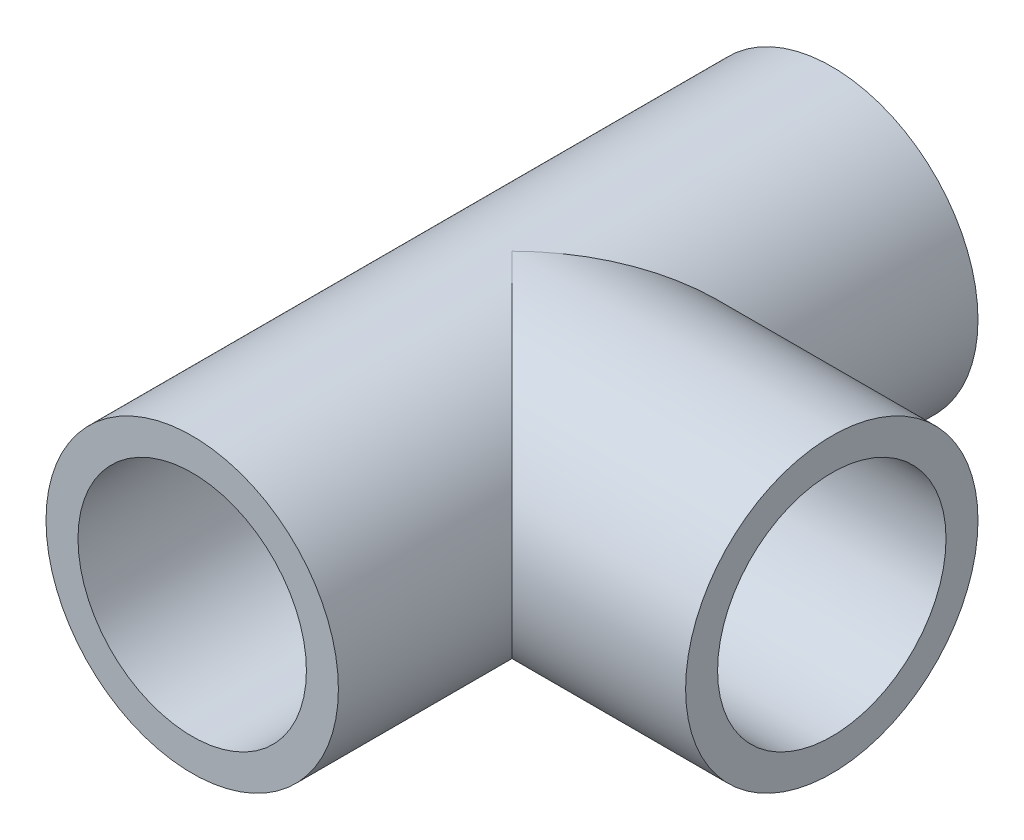
ISO-10303-21;
HEADER;
FILE_DESCRIPTION(('STEP AP214'),'2;1');
FILE_NAME('part.step','',(''),(''),'','','');
FILE_SCHEMA(('AUTOMOTIVE_DESIGN { 1 0 10303 214 1 1 1 1 }'));
ENDSEC;
DATA;
#1=APPLICATION_CONTEXT('core data for automotive mechanical design processes');
#2=APPLICATION_PROTOCOL_DEFINITION('international standard','automotive_design',2000,#1);
#3=PRODUCT_CONTEXT('',#1,'mechanical');
#4=PRODUCT('Part','Part','',(#3));
#5=PRODUCT_RELATED_PRODUCT_CATEGORY('part','',(#4));
#6=PRODUCT_DEFINITION_FORMATION('','',#4);
#7=PRODUCT_DEFINITION_CONTEXT('part definition',#1,'design');
#8=PRODUCT_DEFINITION('design','',#6,#7);
#9=PRODUCT_DEFINITION_SHAPE('','',#8);
#10=(LENGTH_UNIT() NAMED_UNIT(*) SI_UNIT(.MILLI.,.METRE.));
#11=(NAMED_UNIT(*) PLANE_ANGLE_UNIT() SI_UNIT($,.RADIAN.));
#12=(NAMED_UNIT(*) SI_UNIT($,.STERADIAN.) SOLID_ANGLE_UNIT());
#13=UNCERTAINTY_MEASURE_WITH_UNIT(LENGTH_MEASURE(1.E-05),#10,'distance_accuracy_value','');
#14=(GEOMETRIC_REPRESENTATION_CONTEXT(3) GLOBAL_UNCERTAINTY_ASSIGNED_CONTEXT((#13)) GLOBAL_UNIT_ASSIGNED_CONTEXT((#10,
#11,#12)) REPRESENTATION_CONTEXT('',''));
#15=CARTESIAN_POINT('',(0.,0.,0.));
#16=DIRECTION('',(0.,0.,1.));
#17=DIRECTION('',(1.,0.,0.));
#18=AXIS2_PLACEMENT_3D('',#15,#16,#17);
#19=CARTESIAN_POINT('',(0.,0.,35.));
#20=DIRECTION('',(0.,0.,-1.));
#21=DIRECTION('',(-1.,0.,0.));
#22=AXIS2_PLACEMENT_3D('',#19,#20,#21);
#23=CYLINDRICAL_SURFACE('',#22,16.);
#24=CARTESIAN_POINT('',(0.,0.,-35.));
#25=DIRECTION('',(0.,0.,1.));
#26=DIRECTION('',(1.,0.,0.));
#27=AXIS2_PLACEMENT_3D('',#24,#25,#26);
#28=CIRCLE('',#27,16.);
#29=CARTESIAN_POINT('',(16.,0.,-35.));
#30=VERTEX_POINT('',#29);
#31=EDGE_CURVE('E107',#30,#30,#28,.T.);
#32=ORIENTED_EDGE('',*,*,#31,.T.);
#33=EDGE_LOOP('',(#32));
#34=FACE_BOUND('',#33,.T.);
#35=CARTESIAN_POINT('',(0.,0.,35.));
#36=DIRECTION('',(0.,0.,1.));
#37=DIRECTION('',(1.,0.,0.));
#38=AXIS2_PLACEMENT_3D('',#35,#36,#37);
#39=CIRCLE('',#38,16.);
#40=CARTESIAN_POINT('',(16.,0.,35.));
#41=VERTEX_POINT('',#40);
#42=EDGE_CURVE('E110',#41,#41,#39,.T.);
#43=ORIENTED_EDGE('',*,*,#42,.F.);
#44=EDGE_LOOP('',(#43));
#45=FACE_BOUND('',#44,.T.);
#46=CARTESIAN_POINT('',(0.,0.,0.));
#47=DIRECTION('',(-0.707106781186547,0.,-0.707106781186547));
#48=DIRECTION('',(0.707106781186547,0.,-0.707106781186547));
#49=AXIS2_PLACEMENT_3D('',#46,#47,#48);
#50=ELLIPSE('',#49,22.6274169979695,16.);
#51=CARTESIAN_POINT('',(0.,-16.,0.));
#52=VERTEX_POINT('',#51);
#53=CARTESIAN_POINT('',(0.,16.,0.));
#54=VERTEX_POINT('',#53);
#55=EDGE_CURVE('E86',#52,#54,#50,.F.);
#56=ORIENTED_EDGE('',*,*,#55,.F.);
#57=CARTESIAN_POINT('',(0.,0.,0.));
#58=DIRECTION('',(0.707106781186547,0.,-0.707106781186547));
#59=DIRECTION('',(-0.707106781186547,0.,-0.707106781186547));
#60=AXIS2_PLACEMENT_3D('',#57,#58,#59);
#61=ELLIPSE('',#60,22.6274169979695,16.);
#62=EDGE_CURVE('E88',#54,#52,#61,.T.);
#63=ORIENTED_EDGE('',*,*,#62,.F.);
#64=EDGE_LOOP('',(#56,#63));
#65=FACE_BOUND('',#64,.T.);
#66=ADVANCED_FACE('F37',(#34,#45,#65),#23,.T.);
#67=CARTESIAN_POINT('',(0.,0.,35.));
#68=DIRECTION('',(0.,0.,-1.));
#69=DIRECTION('',(-1.,0.,0.));
#70=AXIS2_PLACEMENT_3D('',#67,#68,#69);
#71=CYLINDRICAL_SURFACE('',#70,12.5);
#72=CARTESIAN_POINT('',(0.,0.,35.));
#73=DIRECTION('',(0.,0.,1.));
#74=DIRECTION('',(1.,0.,0.));
#75=AXIS2_PLACEMENT_3D('',#72,#73,#74);
#76=CIRCLE('',#75,12.5);
#77=CARTESIAN_POINT('',(12.5,0.,35.));
#78=VERTEX_POINT('',#77);
#79=EDGE_CURVE('E104',#78,#78,#76,.T.);
#80=ORIENTED_EDGE('',*,*,#79,.T.);
#81=EDGE_LOOP('',(#80));
#82=FACE_BOUND('',#81,.T.);
#83=CARTESIAN_POINT('',(0.,0.,-35.));
#84=DIRECTION('',(0.,0.,1.));
#85=DIRECTION('',(1.,0.,0.));
#86=AXIS2_PLACEMENT_3D('',#83,#84,#85);
#87=CIRCLE('',#86,12.5);
#88=CARTESIAN_POINT('',(12.5,0.,-35.));
#89=VERTEX_POINT('',#88);
#90=EDGE_CURVE('E90',#89,#89,#87,.T.);
#91=ORIENTED_EDGE('',*,*,#90,.F.);
#92=EDGE_LOOP('',(#91));
#93=FACE_BOUND('',#92,.T.);
#94=CARTESIAN_POINT('',(0.,12.5,9.98749217771909));
#95=CARTESIAN_POINT('',(0.144765939258269,12.5000039713035,9.9874792375071));
#96=CARTESIAN_POINT('',(0.289500768758806,12.4974842219506,9.99064164597223));
#97=CARTESIAN_POINT('',(0.578496388531646,12.4874428530207,10.0031928812679));
#98=CARTESIAN_POINT('',(0.722757272903658,12.4799222952672,10.0125803863203));
#99=CARTESIAN_POINT('',(1.15346240868712,12.4499846032809,10.0498235033874));
#100=CARTESIAN_POINT('',(1.43868016846623,12.4201908621868,10.086761191272));
#101=CARTESIAN_POINT('',(1.99838143732547,12.3424144689702,10.1817705778644));
#102=CARTESIAN_POINT('',(2.27296204134154,12.2947136259312,10.2395143074388));
#103=CARTESIAN_POINT('',(2.8142411856663,12.1822217089497,10.3730943724714));
#104=CARTESIAN_POINT('',(3.08093393454397,12.1174184082355,10.4489436481017));
#105=CARTESIAN_POINT('',(3.66587879723391,11.9550657753382,10.634607832145));
#106=CARTESIAN_POINT('',(3.98177716623853,11.8534088032738,10.7482208979897));
#107=CARTESIAN_POINT('',(4.59892316278278,11.6278940118057,10.9917979176121));
#108=CARTESIAN_POINT('',(4.90016766189858,11.5040314779987,11.1217653417897));
#109=CARTESIAN_POINT('',(5.4897150239081,11.2347095097614,11.3937772832068));
#110=CARTESIAN_POINT('',(5.77792676334296,11.0891217721173,11.535891246081));
#111=CARTESIAN_POINT('',(6.33950858826032,10.7779255937651,11.8271616260655));
#112=CARTESIAN_POINT('',(6.61287986056642,10.6123187574545,11.9763174782319));
#113=CARTESIAN_POINT('',(7.15178768157901,10.2571325058059,12.282001520992));
#114=CARTESIAN_POINT('',(7.41693488086361,10.0670411636648,12.4386205480631));
#115=CARTESIAN_POINT('',(7.93149504051984,9.66683070553962,12.7521376989664));
#116=CARTESIAN_POINT('',(8.18090746714291,9.45671091076489,12.909035832081));
#117=CARTESIAN_POINT('',(8.66300567572775,9.0171243831435,13.2198257919539));
#118=CARTESIAN_POINT('',(8.89572270172659,8.7876956327564,13.3737228197949));
#119=CARTESIAN_POINT('',(9.34408100362736,8.30936729608235,13.6760542441486));
#120=CARTESIAN_POINT('',(9.55972331331234,8.06046889039586,13.8244889710827));
#121=CARTESIAN_POINT('',(9.96348044291906,7.55505976650153,14.1067737967742));
#122=CARTESIAN_POINT('',(10.1523952110983,7.29938788073774,14.2409792968047));
#123=CARTESIAN_POINT('',(10.5121729040342,6.77099323074985,14.4996604904861));
#124=CARTESIAN_POINT('',(10.6830382089783,6.49827272230116,14.6241374664755));
#125=CARTESIAN_POINT('',(11.0050875858175,5.9365654161209,14.8610249120178));
#126=CARTESIAN_POINT('',(11.156278832046,5.64758460323973,14.9734397774965));
#127=CARTESIAN_POINT('',(11.4372550959724,5.05438832992194,15.1839436527159));
#128=CARTESIAN_POINT('',(11.5670437810643,4.7501754912099,15.2820351164844));
#129=CARTESIAN_POINT('',(11.7851804238597,4.17597912731154,15.4478563972793));
#130=CARTESIAN_POINT('',(11.876831858331,3.90792600784162,15.5179355333653));
#131=CARTESIAN_POINT('',(12.0423676196806,3.36338036329094,15.6449928218223));
#132=CARTESIAN_POINT('',(12.1162552003071,3.08688939421571,15.7019733733349));
#133=CARTESIAN_POINT('',(12.2452371994632,2.52717224661567,15.8017139021477));
#134=CARTESIAN_POINT('',(12.300340890901,2.24394946542267,15.8444808958915));
#135=CARTESIAN_POINT('',(12.3909787621484,1.6725200915697,15.9149470934331));
#136=CARTESIAN_POINT('',(12.4265127222875,1.38431344300321,15.942646128093));
#137=CARTESIAN_POINT('',(12.4775157847035,0.804148322051992,15.9824323505704));
#138=CARTESIAN_POINT('',(12.4929225558123,0.51218100918579,15.9944710399407));
#139=CARTESIAN_POINT('',(12.5032079106027,-0.0723381895796762,16.0025059781158));
#140=CARTESIAN_POINT('',(12.498086451029,-0.364890076709409,15.9985021931173));
#141=CARTESIAN_POINT('',(12.4674010437957,-0.948287046326773,15.9745421702461));
#142=CARTESIAN_POINT('',(12.441834940023,-1.23913194553466,15.9545842498341));
#143=CARTESIAN_POINT('',(12.3706812842126,-1.81685212217066,15.899159036913));
#144=CARTESIAN_POINT('',(12.3250940522936,-2.10372746299256,15.86369199238));
#145=CARTESIAN_POINT('',(12.2171573641478,-2.65842227512138,15.7799819673798));
#146=CARTESIAN_POINT('',(12.1556741611659,-2.92651173240639,15.7324007549696));
#147=CARTESIAN_POINT('',(12.0159531165259,-3.45568496999959,15.6246967709757));
#148=CARTESIAN_POINT('',(11.9377159190807,-3.71676901924065,15.5645744816152));
#149=CARTESIAN_POINT('',(11.7654161700808,-4.23065378130327,15.4328200996928));
#150=CARTESIAN_POINT('',(11.6713537656552,-4.4834545711094,15.3611881141386));
#151=CARTESIAN_POINT('',(11.4683544362756,-4.97983789756668,15.2075229426086));
#152=CARTESIAN_POINT('',(11.3594120884665,-5.22341703194712,15.1254859654135));
#153=CARTESIAN_POINT('',(11.1157303599794,-5.72504023968639,14.943301245629));
#154=CARTESIAN_POINT('',(10.9794899633515,-5.98199334885024,14.842158536431));
#155=CARTESIAN_POINT('',(10.6913468975092,-6.4829506854815,14.6302891095967));
#156=CARTESIAN_POINT('',(10.5394377149198,-6.7269494635907,14.5195584094129));
#157=CARTESIAN_POINT('',(10.2210905998917,-7.20145547388481,14.2901541196085));
#158=CARTESIAN_POINT('',(10.0546482276095,-7.43195854699469,14.1714781053205));
#159=CARTESIAN_POINT('',(9.70831036964397,-7.87900051778326,13.927890793563));
#160=CARTESIAN_POINT('',(9.52841816290131,-8.09554279515161,13.8029810182779));
#161=CARTESIAN_POINT('',(9.11792625293418,-8.55729830916146,13.5225633798666));
#162=CARTESIAN_POINT('',(8.88447009576638,-8.79934490296252,13.3660130814476));
#163=CARTESIAN_POINT('',(8.40020433766377,-9.26277096815218,13.049133525471));
#164=CARTESIAN_POINT('',(8.14939166441938,-9.48414676418715,12.8888036022038));
#165=CARTESIAN_POINT('',(7.63064594301947,-9.90632547082447,12.567228820053));
#166=CARTESIAN_POINT('',(7.36268307750842,-10.1070908789,12.4059828376629));
#167=CARTESIAN_POINT('',(6.81037591670874,-10.4871898502785,12.0863751803195));
#168=CARTESIAN_POINT('',(6.5260341898327,-10.6665267603545,11.9280130582389));
#169=CARTESIAN_POINT('',(5.98481380594213,-10.9779008293737,11.6414570646984));
#170=CARTESIAN_POINT('',(5.73020517456384,-11.1129987895535,11.5122986456666));
#171=CARTESIAN_POINT('',(5.20902214604569,-11.3666209943456,11.2619564327387));
#172=CARTESIAN_POINT('',(4.94244752027508,-11.4851449221045,11.1407727913235));
#173=CARTESIAN_POINT('',(4.39884389627542,-11.7040826925897,10.9105247522671));
#174=CARTESIAN_POINT('',(4.12188133261541,-11.8045936478164,10.8013966636955));
#175=CARTESIAN_POINT('',(3.5564070319716,-11.987083212473,10.598512500232));
#176=CARTESIAN_POINT('',(3.26789783767151,-12.0690658758741,10.5047530639306));
#177=CARTESIAN_POINT('',(2.73826613141618,-12.1988050653855,10.3536003368885));
#178=CARTESIAN_POINT('',(2.49902537525858,-12.2501230530087,10.292681808935));
#179=CARTESIAN_POINT('',(2.01477142374001,-12.3390135419168,10.1859500180524));
#180=CARTESIAN_POINT('',(1.76976115468981,-12.3765928581904,10.1401292670747));
#181=CARTESIAN_POINT('',(1.27208965311822,-12.4376601532868,10.0651385806626));
#182=CARTESIAN_POINT('',(1.01937043176317,-12.4609593737819,10.0361919260033));
#183=CARTESIAN_POINT('',(0.638333471263218,-12.4843420662299,10.0070644917871));
#184=CARTESIAN_POINT('',(0.510864658253595,-12.4902086680948,9.99973728452525));
#185=CARTESIAN_POINT('',(0.255604354712135,-12.4980390746827,9.98994692418026));
#186=CARTESIAN_POINT('',(0.127812823775837,-12.5000023637012,9.98748441381945));
#187=CARTESIAN_POINT('',(0.,-12.5,9.98749217771921));
#188=B_SPLINE_CURVE_WITH_KNOTS('',3,(#94,#95,#96,#97,#98,#99,#100,#101,#102,#103,#104,#105,#106,
#107,#108,#109,#110,#111,#112,#113,#114,#115,#116,#117,#118,#119,#120,#121,#122,#123,#124,#125,
#126,#127,#128,#129,#130,#131,#132,#133,#134,#135,#136,#137,#138,#139,#140,#141,#142,#143,#144,
#145,#146,#147,#148,#149,#150,#151,#152,#153,#154,#155,#156,#157,#158,#159,#160,#161,#162,#163,
#164,#165,#166,#167,#168,#169,#170,#171,#172,#173,#174,#175,#176,#177,#178,#179,#180,#181,#182,
#183,#184,#185,#186,#187),.UNSPECIFIED.,.F.,.F.,(4,2,2,2,2,2,2,2,2,2,2,2,2,2,2,2,2,2,2,2,2,2,2,
2,2,2,2,2,2,2,2,2,2,2,2,2,2,2,2,2,2,2,2,2,2,2,4),(0.,0.434181679016579,0.86827119750537,
1.73391116185585,2.58646349016976,3.43962697822759,4.49026308996789,5.54112252416605,
6.59845349035484,7.65569977460251,8.7404750846385,9.82528717221699,10.9080130967421,
11.9906734177792,13.0248938601342,14.0589777488613,15.0926834859387,16.1262119099242,
17.0008029985086,17.87523376879,18.7492322378148,19.6232405172795,20.4999491150294,
21.37665956011,22.2534624761704,23.1302513735011,23.9667611934174,24.8032388542103,
25.6397087385786,26.4764842839669,27.3993708526656,28.3226426151419,29.2461974277178,
30.1695278160733,31.2812778538504,32.3932251904797,33.5071612344747,34.6209230722451,
35.5677786973426,36.5146524214408,37.4562567666843,38.3976548899784,39.1533113794086,
39.9085925195615,40.673653214973,41.056961032835,41.4403194898288),.UNSPECIFIED.);
#189=CARTESIAN_POINT('',(0.,12.5,9.98749217771909));
#190=VERTEX_POINT('',#189);
#191=CARTESIAN_POINT('',(0.,-12.5,9.98749217771909));
#192=VERTEX_POINT('',#191);
#193=EDGE_CURVE('E42',#190,#192,#188,.T.);
#194=ORIENTED_EDGE('',*,*,#193,.T.);
#195=DIRECTION('',(0.,0.,-1.));
#196=VECTOR('',#195,1.);
#197=CARTESIAN_POINT('',(0.,-12.5,35.));
#198=LINE('',#197,#196);
#199=CARTESIAN_POINT('',(0.,-12.5,0.));
#200=VERTEX_POINT('',#199);
#201=EDGE_CURVE('E11',#192,#200,#198,.T.);
#202=ORIENTED_EDGE('',*,*,#201,.T.);
#203=CARTESIAN_POINT('',(0.,-12.5,-9.98749217771909));
#204=VERTEX_POINT('',#203);
#205=EDGE_CURVE('E55',#200,#204,#198,.T.);
#206=ORIENTED_EDGE('',*,*,#205,.T.);
#207=CARTESIAN_POINT('',(0.,-12.5,-9.98749217771909));
#208=CARTESIAN_POINT('',(0.144765939258269,-12.5000039713035,-9.9874792375071));
#209=CARTESIAN_POINT('',(0.289500768758806,-12.4974842219506,-9.99064164597223));
#210=CARTESIAN_POINT('',(0.578496388531646,-12.4874428530207,-10.0031928812679));
#211=CARTESIAN_POINT('',(0.722757272903658,-12.4799222952672,-10.0125803863203));
#212=CARTESIAN_POINT('',(1.15346240868712,-12.4499846032809,-10.0498235033874));
#213=CARTESIAN_POINT('',(1.43868016846623,-12.4201908621868,-10.086761191272));
#214=CARTESIAN_POINT('',(1.99838143732547,-12.3424144689702,-10.1817705778644));
#215=CARTESIAN_POINT('',(2.27296204134154,-12.2947136259312,-10.2395143074388));
#216=CARTESIAN_POINT('',(2.8142411856663,-12.1822217089497,-10.3730943724714));
#217=CARTESIAN_POINT('',(3.08093393454397,-12.1174184082355,-10.4489436481017));
#218=CARTESIAN_POINT('',(3.66587879723391,-11.9550657753382,-10.634607832145));
#219=CARTESIAN_POINT('',(3.98177716623853,-11.8534088032738,-10.7482208979897));
#220=CARTESIAN_POINT('',(4.59892316278278,-11.6278940118057,-10.9917979176121));
#221=CARTESIAN_POINT('',(4.90016766189858,-11.5040314779987,-11.1217653417897));
#222=CARTESIAN_POINT('',(5.4897150239081,-11.2347095097614,-11.3937772832068));
#223=CARTESIAN_POINT('',(5.77792676334296,-11.0891217721173,-11.535891246081));
#224=CARTESIAN_POINT('',(6.33950858826032,-10.7779255937651,-11.8271616260655));
#225=CARTESIAN_POINT('',(6.61287986056642,-10.6123187574545,-11.9763174782319));
#226=CARTESIAN_POINT('',(7.15178768157901,-10.2571325058059,-12.282001520992));
#227=CARTESIAN_POINT('',(7.41693488086361,-10.0670411636648,-12.4386205480631));
#228=CARTESIAN_POINT('',(7.93149504051984,-9.66683070553962,-12.7521376989664));
#229=CARTESIAN_POINT('',(8.18090746714291,-9.45671091076489,-12.909035832081));
#230=CARTESIAN_POINT('',(8.66300567572775,-9.0171243831435,-13.2198257919539));
#231=CARTESIAN_POINT('',(8.89572270172659,-8.7876956327564,-13.3737228197949));
#232=CARTESIAN_POINT('',(9.34408100362736,-8.30936729608235,-13.6760542441486));
#233=CARTESIAN_POINT('',(9.55972331331234,-8.06046889039586,-13.8244889710827));
#234=CARTESIAN_POINT('',(9.96348044291906,-7.55505976650153,-14.1067737967742));
#235=CARTESIAN_POINT('',(10.1523952110983,-7.29938788073774,-14.2409792968047));
#236=CARTESIAN_POINT('',(10.5121729040342,-6.77099323074985,-14.4996604904861));
#237=CARTESIAN_POINT('',(10.6830382089783,-6.49827272230116,-14.6241374664755));
#238=CARTESIAN_POINT('',(11.0050875858175,-5.9365654161209,-14.8610249120178));
#239=CARTESIAN_POINT('',(11.156278832046,-5.64758460323973,-14.9734397774965));
#240=CARTESIAN_POINT('',(11.4372550959724,-5.05438832992194,-15.1839436527159));
#241=CARTESIAN_POINT('',(11.5670437810643,-4.7501754912099,-15.2820351164844));
#242=CARTESIAN_POINT('',(11.7851804238597,-4.17597912731154,-15.4478563972793));
#243=CARTESIAN_POINT('',(11.876831858331,-3.90792600784162,-15.5179355333653));
#244=CARTESIAN_POINT('',(12.0423676196806,-3.36338036329094,-15.6449928218223));
#245=CARTESIAN_POINT('',(12.1162552003071,-3.08688939421571,-15.7019733733349));
#246=CARTESIAN_POINT('',(12.2452371994632,-2.52717224661567,-15.8017139021477));
#247=CARTESIAN_POINT('',(12.300340890901,-2.24394946542267,-15.8444808958915));
#248=CARTESIAN_POINT('',(12.3909787621484,-1.6725200915697,-15.9149470934331));
#249=CARTESIAN_POINT('',(12.4265127222875,-1.38431344300321,-15.942646128093));
#250=CARTESIAN_POINT('',(12.4775157847035,-0.804148322051992,-15.9824323505704));
#251=CARTESIAN_POINT('',(12.4929225558123,-0.51218100918579,-15.9944710399407));
#252=CARTESIAN_POINT('',(12.5032079106027,0.0723381895796762,-16.0025059781158));
#253=CARTESIAN_POINT('',(12.498086451029,0.364890076709409,-15.9985021931173));
#254=CARTESIAN_POINT('',(12.4674010437957,0.948287046326773,-15.9745421702461));
#255=CARTESIAN_POINT('',(12.441834940023,1.23913194553466,-15.9545842498341));
#256=CARTESIAN_POINT('',(12.3706812842126,1.81685212217066,-15.899159036913));
#257=CARTESIAN_POINT('',(12.3250940522936,2.10372746299256,-15.86369199238));
#258=CARTESIAN_POINT('',(12.2171573641478,2.65842227512138,-15.7799819673798));
#259=CARTESIAN_POINT('',(12.1556741611659,2.92651173240639,-15.7324007549696));
#260=CARTESIAN_POINT('',(12.0159531165259,3.45568496999959,-15.6246967709757));
#261=CARTESIAN_POINT('',(11.9377159190807,3.71676901924065,-15.5645744816152));
#262=CARTESIAN_POINT('',(11.7654161700808,4.23065378130327,-15.4328200996928));
#263=CARTESIAN_POINT('',(11.6713537656552,4.4834545711094,-15.3611881141386));
#264=CARTESIAN_POINT('',(11.4683544362756,4.97983789756668,-15.2075229426086));
#265=CARTESIAN_POINT('',(11.3594120884665,5.22341703194712,-15.1254859654135));
#266=CARTESIAN_POINT('',(11.1157303599794,5.72504023968639,-14.943301245629));
#267=CARTESIAN_POINT('',(10.9794899633515,5.98199334885024,-14.842158536431));
#268=CARTESIAN_POINT('',(10.6913468975092,6.4829506854815,-14.6302891095967));
#269=CARTESIAN_POINT('',(10.5394377149198,6.7269494635907,-14.5195584094129));
#270=CARTESIAN_POINT('',(10.2210905998917,7.20145547388481,-14.2901541196085));
#271=CARTESIAN_POINT('',(10.0546482276095,7.43195854699469,-14.1714781053205));
#272=CARTESIAN_POINT('',(9.70831036964397,7.87900051778326,-13.927890793563));
#273=CARTESIAN_POINT('',(9.52841816290131,8.09554279515161,-13.8029810182779));
#274=CARTESIAN_POINT('',(9.11792625293418,8.55729830916146,-13.5225633798666));
#275=CARTESIAN_POINT('',(8.88447009576638,8.79934490296252,-13.3660130814476));
#276=CARTESIAN_POINT('',(8.40020433766377,9.26277096815218,-13.049133525471));
#277=CARTESIAN_POINT('',(8.14939166441938,9.48414676418715,-12.8888036022038));
#278=CARTESIAN_POINT('',(7.63064594301947,9.90632547082447,-12.567228820053));
#279=CARTESIAN_POINT('',(7.36268307750842,10.1070908789,-12.4059828376629));
#280=CARTESIAN_POINT('',(6.81037591670874,10.4871898502785,-12.0863751803195));
#281=CARTESIAN_POINT('',(6.5260341898327,10.6665267603545,-11.9280130582389));
#282=CARTESIAN_POINT('',(5.98481380594213,10.9779008293737,-11.6414570646984));
#283=CARTESIAN_POINT('',(5.73020517456384,11.1129987895535,-11.5122986456666));
#284=CARTESIAN_POINT('',(5.20902214604569,11.3666209943456,-11.2619564327387));
#285=CARTESIAN_POINT('',(4.94244752027508,11.4851449221045,-11.1407727913235));
#286=CARTESIAN_POINT('',(4.39884389627542,11.7040826925897,-10.9105247522671));
#287=CARTESIAN_POINT('',(4.12188133261541,11.8045936478164,-10.8013966636955));
#288=CARTESIAN_POINT('',(3.5564070319716,11.987083212473,-10.598512500232));
#289=CARTESIAN_POINT('',(3.26789783767151,12.0690658758741,-10.5047530639306));
#290=CARTESIAN_POINT('',(2.73826613141618,12.1988050653855,-10.3536003368885));
#291=CARTESIAN_POINT('',(2.49902537525858,12.2501230530087,-10.292681808935));
#292=CARTESIAN_POINT('',(2.01477142374001,12.3390135419168,-10.1859500180524));
#293=CARTESIAN_POINT('',(1.76976115468981,12.3765928581904,-10.1401292670747));
#294=CARTESIAN_POINT('',(1.27208965311822,12.4376601532868,-10.0651385806626));
#295=CARTESIAN_POINT('',(1.01937043176317,12.4609593737819,-10.0361919260033));
#296=CARTESIAN_POINT('',(0.638333471263218,12.4843420662299,-10.0070644917871));
#297=CARTESIAN_POINT('',(0.510864658253595,12.4902086680948,-9.99973728452525));
#298=CARTESIAN_POINT('',(0.255604354712135,12.4980390746827,-9.98994692418026));
#299=CARTESIAN_POINT('',(0.127812823775837,12.5000023637012,-9.98748441381945));
#300=CARTESIAN_POINT('',(0.,12.5,-9.98749217771921));
#301=B_SPLINE_CURVE_WITH_KNOTS('',3,(#207,#208,#209,#210,#211,#212,#213,#214,#215,#216,#217,
#218,#219,#220,#221,#222,#223,#224,#225,#226,#227,#228,#229,#230,#231,#232,#233,#234,#235,#236,
#237,#238,#239,#240,#241,#242,#243,#244,#245,#246,#247,#248,#249,#250,#251,#252,#253,#254,#255,
#256,#257,#258,#259,#260,#261,#262,#263,#264,#265,#266,#267,#268,#269,#270,#271,#272,#273,#274,
#275,#276,#277,#278,#279,#280,#281,#282,#283,#284,#285,#286,#287,#288,#289,#290,#291,#292,#293,
#294,#295,#296,#297,#298,#299,#300),.UNSPECIFIED.,.F.,.F.,(4,2,2,2,2,2,2,2,2,2,2,2,2,2,2,2,2,2,
2,2,2,2,2,2,2,2,2,2,2,2,2,2,2,2,2,2,2,2,2,2,2,2,2,2,2,2,4),(0.,0.434181679016579,
0.86827119750537,1.73391116185585,2.58646349016976,3.43962697822759,4.49026308996789,
5.54112252416605,6.59845349035484,7.65569977460251,8.7404750846385,9.82528717221699,
10.9080130967421,11.9906734177792,13.0248938601342,14.0589777488613,15.0926834859387,
16.1262119099242,17.0008029985086,17.87523376879,18.7492322378148,19.6232405172795,
20.4999491150294,21.37665956011,22.2534624761704,23.1302513735011,23.9667611934174,
24.8032388542103,25.6397087385786,26.4764842839669,27.3993708526656,28.3226426151419,
29.2461974277178,30.1695278160733,31.2812778538504,32.3932251904797,33.5071612344747,
34.6209230722451,35.5677786973426,36.5146524214408,37.4562567666843,38.3976548899784,
39.1533113794086,39.9085925195615,40.673653214973,41.056961032835,41.4403194898288),.UNSPECIFIED.);
#302=CARTESIAN_POINT('',(0.,12.5,-9.98749217771909));
#303=VERTEX_POINT('',#302);
#304=EDGE_CURVE('E121',#204,#303,#301,.T.);
#305=ORIENTED_EDGE('',*,*,#304,.T.);
#306=DIRECTION('',(0.,0.,-1.));
#307=VECTOR('',#306,1.);
#308=CARTESIAN_POINT('',(0.,12.5,35.));
#309=LINE('',#308,#307);
#310=CARTESIAN_POINT('',(0.,12.5,0.));
#311=VERTEX_POINT('',#310);
#312=EDGE_CURVE('E53',#303,#311,#309,.F.);
#313=ORIENTED_EDGE('',*,*,#312,.T.);
#314=EDGE_CURVE('E120',#311,#190,#309,.F.);
#315=ORIENTED_EDGE('',*,*,#314,.T.);
#316=EDGE_LOOP('',(#194,#202,#206,#305,#313,#315));
#317=FACE_BOUND('',#316,.T.);
#318=ADVANCED_FACE('F162',(#82,#93,#317),#71,.F.);
#319=CARTESIAN_POINT('',(0.,0.,35.));
#320=DIRECTION('',(0.,0.,1.));
#321=DIRECTION('',(1.,0.,0.));
#322=AXIS2_PLACEMENT_3D('',#319,#320,#321);
#323=PLANE('',#322);
#324=ORIENTED_EDGE('',*,*,#42,.T.);
#325=EDGE_LOOP('',(#324));
#326=FACE_BOUND('',#325,.T.);
#327=ORIENTED_EDGE('',*,*,#79,.F.);
#328=EDGE_LOOP('',(#327));
#329=FACE_BOUND('',#328,.T.);
#330=ADVANCED_FACE('F155',(#326,#329),#323,.T.);
#331=CARTESIAN_POINT('',(0.,0.,-35.));
#332=DIRECTION('',(0.,0.,1.));
#333=DIRECTION('',(1.,0.,0.));
#334=AXIS2_PLACEMENT_3D('',#331,#332,#333);
#335=PLANE('',#334);
#336=ORIENTED_EDGE('',*,*,#31,.F.);
#337=EDGE_LOOP('',(#336));
#338=FACE_BOUND('',#337,.T.);
#339=ORIENTED_EDGE('',*,*,#90,.T.);
#340=EDGE_LOOP('',(#339));
#341=FACE_BOUND('',#340,.T.);
#342=ADVANCED_FACE('F149',(#338,#341),#335,.F.);
#343=CARTESIAN_POINT('',(35.,0.,0.));
#344=DIRECTION('',(-1.,0.,0.));
#345=DIRECTION('',(0.,0.,1.));
#346=AXIS2_PLACEMENT_3D('',#343,#344,#345);
#347=CYLINDRICAL_SURFACE('',#346,12.5);
#348=CARTESIAN_POINT('',(0.,0.,0.));
#349=DIRECTION('',(1.,0.,0.));
#350=DIRECTION('',(0.,0.,-1.));
#351=AXIS2_PLACEMENT_3D('',#348,#349,#350);
#352=CIRCLE('',#351,12.5);
#353=EDGE_CURVE('E67',#311,#200,#352,.T.);
#354=ORIENTED_EDGE('',*,*,#353,.F.);
#355=CARTESIAN_POINT('',(0.,0.,0.));
#356=DIRECTION('',(0.707106781186547,0.,-0.707106781186547));
#357=DIRECTION('',(-0.707106781186547,0.,-0.707106781186547));
#358=AXIS2_PLACEMENT_3D('',#355,#356,#357);
#359=ELLIPSE('',#358,17.6776695296637,12.5);
#360=EDGE_CURVE('E113',#311,#200,#359,.T.);
#361=ORIENTED_EDGE('',*,*,#360,.T.);
#362=EDGE_LOOP('',(#354,#361));
#363=FACE_BOUND('',#362,.T.);
#364=ADVANCED_FACE('F146',(#363),#347,.F.);
#365=CARTESIAN_POINT('',(35.,0.,0.));
#366=DIRECTION('',(-1.,0.,0.));
#367=DIRECTION('',(0.,0.,1.));
#368=AXIS2_PLACEMENT_3D('',#365,#366,#367);
#369=CYLINDRICAL_SURFACE('',#368,16.);
#370=ORIENTED_EDGE('',*,*,#193,.F.);
#371=CARTESIAN_POINT('',(0.,0.,0.));
#372=DIRECTION('',(1.,0.,0.));
#373=DIRECTION('',(0.,0.,-1.));
#374=AXIS2_PLACEMENT_3D('',#371,#372,#373);
#375=CIRCLE('',#374,16.);
#376=EDGE_CURVE('E258',#190,#192,#375,.T.);
#377=ORIENTED_EDGE('',*,*,#376,.T.);
#378=EDGE_LOOP('',(#370,#377));
#379=FACE_BOUND('',#378,.T.);
#380=ADVANCED_FACE('F135',(#379),#369,.T.);
#381=CARTESIAN_POINT('',(0.,0.,0.));
#382=DIRECTION('',(1.,0.,0.));
#383=DIRECTION('',(0.,0.,-1.));
#384=AXIS2_PLACEMENT_3D('',#381,#382,#383);
#385=PLANE('',#384);
#386=ORIENTED_EDGE('',*,*,#201,.F.);
#387=ORIENTED_EDGE('',*,*,#376,.F.);
#388=ORIENTED_EDGE('',*,*,#314,.F.);
#389=ORIENTED_EDGE('',*,*,#353,.T.);
#390=EDGE_LOOP('',(#386,#387,#388,#389));
#391=FACE_BOUND('',#390,.T.);
#392=ADVANCED_FACE('F141',(#391),#385,.F.);
#393=CARTESIAN_POINT('',(0.,0.,0.));
#394=DIRECTION('',(-0.707106781186547,0.,-0.707106781186547));
#395=DIRECTION('',(0.707106781186547,0.,-0.707106781186547));
#396=AXIS2_PLACEMENT_3D('',#393,#394,#395);
#397=ELLIPSE('',#396,17.6776695296637,12.5);
#398=EDGE_CURVE('E117',#200,#311,#397,.F.);
#399=ORIENTED_EDGE('',*,*,#398,.F.);
#400=ORIENTED_EDGE('',*,*,#360,.F.);
#401=EDGE_LOOP('',(#399,#400));
#402=FACE_BOUND('',#401,.T.);
#403=ADVANCED_FACE('F126',(#402),#71,.F.);
#404=ORIENTED_EDGE('',*,*,#304,.F.);
#405=EDGE_CURVE('E260',#204,#303,#375,.T.);
#406=ORIENTED_EDGE('',*,*,#405,.T.);
#407=EDGE_LOOP('',(#404,#406));
#408=FACE_BOUND('',#407,.T.);
#409=ADVANCED_FACE('F129',(#408),#369,.T.);
#410=EDGE_CURVE('E267',#200,#311,#352,.T.);
#411=ORIENTED_EDGE('',*,*,#410,.F.);
#412=ORIENTED_EDGE('',*,*,#398,.T.);
#413=EDGE_LOOP('',(#411,#412));
#414=FACE_BOUND('',#413,.T.);
#415=ADVANCED_FACE('F133',(#414),#347,.F.);
#416=ORIENTED_EDGE('',*,*,#205,.F.);
#417=ORIENTED_EDGE('',*,*,#410,.T.);
#418=ORIENTED_EDGE('',*,*,#312,.F.);
#419=ORIENTED_EDGE('',*,*,#405,.F.);
#420=EDGE_LOOP('',(#416,#417,#418,#419));
#421=FACE_BOUND('',#420,.T.);
#422=ADVANCED_FACE('F136',(#421),#385,.F.);
#423=CARTESIAN_POINT('',(35.,0.,0.));
#424=DIRECTION('',(1.,0.,0.));
#425=DIRECTION('',(0.,0.,-1.));
#426=AXIS2_PLACEMENT_3D('',#423,#424,#425);
#427=CIRCLE('',#426,16.);
#428=CARTESIAN_POINT('',(35.,0.,-16.));
#429=VERTEX_POINT('',#428);
#430=EDGE_CURVE('E96',#429,#429,#427,.T.);
#431=ORIENTED_EDGE('',*,*,#430,.F.);
#432=EDGE_LOOP('',(#431));
#433=FACE_BOUND('',#432,.T.);
#434=ORIENTED_EDGE('',*,*,#62,.T.);
#435=ORIENTED_EDGE('',*,*,#55,.T.);
#436=EDGE_LOOP('',(#434,#435));
#437=FACE_BOUND('',#436,.T.);
#438=ADVANCED_FACE('F92',(#433,#437),#369,.T.);
#439=CARTESIAN_POINT('',(35.,0.,0.));
#440=DIRECTION('',(1.,0.,0.));
#441=DIRECTION('',(0.,0.,-1.));
#442=AXIS2_PLACEMENT_3D('',#439,#440,#441);
#443=CIRCLE('',#442,12.5);
#444=CARTESIAN_POINT('',(35.,0.,-12.5));
#445=VERTEX_POINT('',#444);
#446=EDGE_CURVE('E264',#445,#445,#443,.T.);
#447=ORIENTED_EDGE('',*,*,#446,.T.);
#448=EDGE_LOOP('',(#447));
#449=FACE_BOUND('',#448,.T.);
#450=CARTESIAN_POINT('',(16.,0.,12.5));
#451=CARTESIAN_POINT('',(15.9999974421394,-0.302086068899075,12.4999973682081));
#452=CARTESIAN_POINT('',(15.9914249243446,-0.604225040769728,12.4890296920464));
#453=CARTESIAN_POINT('',(15.9573271586216,-1.20608996345665,12.445339352573));
#454=CARTESIAN_POINT('',(15.9317926980517,-1.50581451332559,12.4126048669138));
#455=CARTESIAN_POINT('',(15.8643023689664,-2.10089296314134,12.3258603545489));
#456=CARTESIAN_POINT('',(15.8223143137146,-2.39623711158765,12.2718086254316));
#457=CARTESIAN_POINT('',(15.7228737328025,-2.97973825172226,12.1433278454252));
#458=CARTESIAN_POINT('',(15.6654229971501,-3.2678960711061,12.068901153188));
#459=CARTESIAN_POINT('',(15.5366783298358,-3.83343309960619,11.9013121823776));
#460=CARTESIAN_POINT('',(15.4654741610803,-4.11086890962949,11.8082712573827));
#461=CARTESIAN_POINT('',(15.3103629285315,-4.65542172177004,11.604378070839));
#462=CARTESIAN_POINT('',(15.2264557700922,-4.9225386469859,11.4935256765822));
#463=CARTESIAN_POINT('',(15.0474333767051,-5.44527867199804,11.2552844911954));
#464=CARTESIAN_POINT('',(14.9523210498986,-5.70090473039387,11.127899989869));
#465=CARTESIAN_POINT('',(14.7523804458033,-6.19996536656871,10.8577610406062));
#466=CARTESIAN_POINT('',(14.6475502286917,-6.44339749527103,10.7150035230836));
#467=CARTESIAN_POINT('',(14.3930630137541,-6.99722949847224,10.3648075969643));
#468=CARTESIAN_POINT('',(14.2401860793527,-7.30262182392418,10.1517616403518));
#469=CARTESIAN_POINT('',(13.9234599334609,-7.88977901680177,9.70248114917537));
#470=CARTESIAN_POINT('',(13.7596073637975,-8.17153659285534,9.46623950712265));
#471=CARTESIAN_POINT('',(13.4241869483399,-8.71163039073508,8.97172875326761));
#472=CARTESIAN_POINT('',(13.2525998540256,-8.96990273579394,8.7134030681746));
#473=CARTESIAN_POINT('',(12.9059644616742,-9.46185010950938,8.17654918301092));
#474=CARTESIAN_POINT('',(12.7309165309383,-9.69552773195302,7.8980231185384));
#475=CARTESIAN_POINT('',(12.3790090042071,-10.1410963431167,7.31737606325396));
#476=CARTESIAN_POINT('',(12.2021587293083,-10.3526330995184,7.01497743434147));
#477=CARTESIAN_POINT('',(11.8540133636794,-10.7495133386446,6.39022363562565));
#478=CARTESIAN_POINT('',(11.6827199309247,-10.9348490582476,6.06786259166007));
#479=CARTESIAN_POINT('',(11.3521696323118,-11.2776218392972,5.40410923396921));
#480=CARTESIAN_POINT('',(11.1928794009792,-11.4351380053166,5.06277463278317));
#481=CARTESIAN_POINT('',(10.8931680563228,-11.7209952604985,4.36025526843516));
#482=CARTESIAN_POINT('',(10.7527312937742,-11.849360608132,3.99908732316432));
#483=CARTESIAN_POINT('',(10.551313888934,-12.0282936993791,3.40919715127023));
#484=CARTESIAN_POINT('',(10.4813139461115,-12.0892184435145,3.18665600688623));
#485=CARTESIAN_POINT('',(10.3530468400006,-12.1992440571083,2.73538666262126));
#486=CARTESIAN_POINT('',(10.2947754069835,-12.2483492307255,2.50666074881002));
#487=CARTESIAN_POINT('',(10.1920680944096,-12.3339460912489,2.04424651838985));
#488=CARTESIAN_POINT('',(10.1476057579652,-12.3704619130975,1.81056861888553));
#489=CARTESIAN_POINT('',(10.0741736380169,-12.4303372288066,1.33909198561956));
#490=CARTESIAN_POINT('',(10.0452037339663,-12.4536968250358,1.10129328393677));
#491=CARTESIAN_POINT('',(10.0039386535816,-12.4868703247339,0.621527984778925));
#492=CARTESIAN_POINT('',(9.99176706667306,-12.4965838398219,0.379543621009835));
#493=CARTESIAN_POINT('',(9.98510641811693,-12.5019066319259,-0.104818059681993));
#494=CARTESIAN_POINT('',(9.99061674123116,-12.4975163996788,-0.347195362639201));
#495=CARTESIAN_POINT('',(10.0190535416873,-12.4747300982951,-0.830473904475063));
#496=CARTESIAN_POINT('',(10.0419960916156,-12.4563211037657,-1.07137357421846));
#497=CARTESIAN_POINT('',(10.1042078743446,-12.4059085988192,-1.5496060565937));
#498=CARTESIAN_POINT('',(10.1434794125231,-12.3739031688009,-1.78693836066936));
#499=CARTESIAN_POINT('',(10.2452810905859,-12.2898063929332,-2.3000369974279));
#500=CARTESIAN_POINT('',(10.3107710658493,-12.235093534908,-2.57478490968418));
#501=CARTESIAN_POINT('',(10.4589220581354,-12.1086910420131,-3.11557118674474));
#502=CARTESIAN_POINT('',(10.5415871062333,-12.0369974211198,-3.38160748989175));
#503=CARTESIAN_POINT('',(10.7208314199723,-11.8776332139655,-3.90471133597439));
#504=CARTESIAN_POINT('',(10.8174423675734,-11.7899261251843,-4.16175675562451));
#505=CARTESIAN_POINT('',(11.0212329071611,-11.5996498062539,-4.66591211844238));
#506=CARTESIAN_POINT('',(11.128413262379,-11.4970795025603,-4.91302134228743));
#507=CARTESIAN_POINT('',(11.3987704447913,-11.2302284953177,-5.50248778670683));
#508=CARTESIAN_POINT('',(11.5660511020388,-11.0584930137791,-5.83960409061723));
#509=CARTESIAN_POINT('',(11.9096322377339,-10.6875938040353,-6.49359128497384));
#510=CARTESIAN_POINT('',(12.0859363053713,-10.4884191073583,-6.81045400478521));
#511=CARTESIAN_POINT('',(12.4421021350289,-10.0633528448269,-7.42417523918984));
#512=CARTESIAN_POINT('',(12.6219673947986,-9.83743380414462,-7.72101268154337));
#513=CARTESIAN_POINT('',(12.9802663129871,-9.35958755806162,-8.29380454589933));
#514=CARTESIAN_POINT('',(13.1587001764203,-9.10766415154358,-8.56976200800278));
#515=CARTESIAN_POINT('',(13.5130080345627,-8.57339953690671,-9.10451394208712));
#516=CARTESIAN_POINT('',(13.6887804114138,-8.29059787529707,-9.3629169412137));
#517=CARTESIAN_POINT('',(14.0302038678262,-7.69870825515624,-9.85535794127017));
#518=CARTESIAN_POINT('',(14.1958535381996,-7.38961665104693,-10.0893925530398));
#519=CARTESIAN_POINT('',(14.5124245737034,-6.74667595072852,-10.5301426591591));
#520=CARTESIAN_POINT('',(14.6633800396445,-6.41288750135763,-10.7369218205546));
#521=CARTESIAN_POINT('',(14.9467751643582,-5.72130834956196,-11.120829463816));
#522=CARTESIAN_POINT('',(15.0792236231039,-5.36352917517666,-11.2979720456629));
#523=CARTESIAN_POINT('',(15.2858273046979,-4.73482020274804,-11.5720368710058));
#524=CARTESIAN_POINT('',(15.3656653329137,-4.46932634693013,-11.6772237288175));
#525=CARTESIAN_POINT('',(15.5127047831914,-3.92866502014543,-11.870042376256));
#526=CARTESIAN_POINT('',(15.5799093157577,-3.65349995019308,-11.9576784874161));
#527=CARTESIAN_POINT('',(15.7003868989363,-3.09506054609086,-12.1142331789679));
#528=CARTESIAN_POINT('',(15.7536672565136,-2.81179055209083,-12.183161577308));
#529=CARTESIAN_POINT('',(15.8452544046056,-2.23876880840721,-12.3013610879504));
#530=CARTESIAN_POINT('',(15.8835607471092,-1.94901686506278,-12.350631612105));
#531=CARTESIAN_POINT('',(15.9444882151679,-1.36388227508144,-12.4288901905225));
#532=CARTESIAN_POINT('',(15.9670424694523,-1.06848102739645,-12.4577917785909));
#533=CARTESIAN_POINT('',(15.9956844056105,-0.475569072244633,-12.4944808491648));
#534=CARTESIAN_POINT('',(16.0017721308087,-0.178058370329967,-12.5022683872227));
#535=CARTESIAN_POINT('',(15.9973385067131,0.416634161844472,-12.4965932187002));
#536=CARTESIAN_POINT('',(15.9868171389291,0.713815991737759,-12.483130488463));
#537=CARTESIAN_POINT('',(15.9494108340711,1.30542714786924,-12.4351892210078));
#538=CARTESIAN_POINT('',(15.9225264202254,1.59985656181363,-12.4007113557744));
#539=CARTESIAN_POINT('',(15.8552267487128,2.16508039929513,-12.3141748534211));
#540=CARTESIAN_POINT('',(15.8157824442651,2.43618570946838,-12.2633759469703));
#541=CARTESIAN_POINT('',(15.7238448384223,2.97231786077219,-12.1445754035798));
#542=CARTESIAN_POINT('',(15.6713522086613,3.23734501399584,-12.0765746520642));
#543=CARTESIAN_POINT('',(15.5542574842679,3.75989010492668,-11.9242315989146));
#544=CARTESIAN_POINT('',(15.4896557470668,4.01740826402181,-11.8398897796264));
#545=CARTESIAN_POINT('',(15.3493899146533,4.52385994937893,-11.6557850845926));
#546=CARTESIAN_POINT('',(15.2737217425009,4.77279026987905,-11.5560165247653));
#547=CARTESIAN_POINT('',(15.1060216573916,5.28064775614232,-11.3334754189369));
#548=CARTESIAN_POINT('',(15.0131638783954,5.53877415836593,-11.2094993459852));
#549=CARTESIAN_POINT('',(14.8173822008094,6.04304437942303,-10.9458945657667));
#550=CARTESIAN_POINT('',(14.7144541590426,6.28918320333554,-10.806259412449));
#551=CARTESIAN_POINT('',(14.5000855431086,6.76879022293734,-10.5124959453495));
#552=CARTESIAN_POINT('',(14.3886441155942,7.00225714442409,-10.3583661783277));
#553=CARTESIAN_POINT('',(14.1587826776149,7.45611148729514,-10.0366228266647));
#554=CARTESIAN_POINT('',(14.0403617386199,7.67649716053228,-9.86900744685652));
#555=CARTESIAN_POINT('',(13.7744264848721,8.14563443909763,-9.48720723042718));
#556=CARTESIAN_POINT('',(13.62574479343,8.39152755290939,-9.27031808862871));
#557=CARTESIAN_POINT('',(13.3232439791385,8.86396444650371,-8.81967903318063));
#558=CARTESIAN_POINT('',(13.1694240940702,9.09050533761465,-8.58592661195126));
#559=CARTESIAN_POINT('',(12.8592187554007,9.52426706211859,-8.10210049377556));
#560=CARTESIAN_POINT('',(12.70283037912,9.73146379143165,-7.85200707714576));
#561=CARTESIAN_POINT('',(12.3906616403937,10.1259443545649,-7.33625621146153));
#562=CARTESIAN_POINT('',(12.2348812265772,10.3132299075164,-7.07060010916645));
#563=CARTESIAN_POINT('',(11.935228893352,10.6583204420272,-6.53801331692407));
#564=CARTESIAN_POINT('',(11.7911576585593,10.8171489028301,-6.27185838639427));
#565=CARTESIAN_POINT('',(11.5098881459102,11.1159599612082,-5.72558865717238));
#566=CARTESIAN_POINT('',(11.3726907520338,11.2559401387687,-5.44547207219584));
#567=CARTESIAN_POINT('',(11.1093891238304,11.5158864141183,-4.87169399654515));
#568=CARTESIAN_POINT('',(10.9832667785678,11.6358854861957,-4.57805586349849));
#569=CARTESIAN_POINT('',(10.7466265630456,11.8547878836065,-3.97695814710389));
#570=CARTESIAN_POINT('',(10.6361015473808,11.9537008795086,-3.66950497832927));
#571=CARTESIAN_POINT('',(10.4661194962068,12.1024383904446,-3.13576694931029));
#572=CARTESIAN_POINT('',(10.4012900176912,12.1580868092935,-2.91280712099205));
#573=CARTESIAN_POINT('',(10.2839428958447,12.2575053261081,-2.46109841387878));
#574=CARTESIAN_POINT('',(10.2314213548982,12.3012791851433,-2.23235139323563));
#575=CARTESIAN_POINT('',(10.1406676377902,12.3762002248096,-1.77039893440051));
#576=CARTESIAN_POINT('',(10.102410458341,12.4073695075655,-1.53720205782144));
#577=CARTESIAN_POINT('',(10.0416649418956,12.4565848500437,-1.06736579571659));
#578=CARTESIAN_POINT('',(10.0191763405556,12.4746311297597,-0.830726467967833));
#579=CARTESIAN_POINT('',(9.99093601573296,12.4972611414391,-0.354430962232374));
#580=CARTESIAN_POINT('',(9.98528078088123,12.5017672627874,-0.114765269996574));
#581=CARTESIAN_POINT('',(9.9912609501493,12.4969883172861,0.3642035341835));
#582=CARTESIAN_POINT('',(10.0028960477791,12.4877034948961,0.603506652479525));
#583=CARTESIAN_POINT('',(10.0429097574309,12.4555454835047,1.08004034377274));
#584=CARTESIAN_POINT('',(10.0713071799927,12.4326570284224,1.3172682840358));
#585=CARTESIAN_POINT('',(10.1435590377467,12.3737772943463,1.78769809259956));
#586=CARTESIAN_POINT('',(10.1874157605111,12.3377840761645,2.02089935969785));
#587=CARTESIAN_POINT('',(10.3007314693892,12.2434295242092,2.53617919630832));
#588=CARTESIAN_POINT('',(10.3737847390451,12.1817996936787,2.81686856432041));
#589=CARTESIAN_POINT('',(10.536993951629,12.0409031805929,3.36865206920003));
#590=CARTESIAN_POINT('',(10.6271547346126,11.9616315057091,3.63974346479255));
#591=CARTESIAN_POINT('',(10.8210769485958,11.7864917397785,4.17221165338822));
#592=CARTESIAN_POINT('',(10.9248693270179,11.6905857204304,4.43356454991106));
#593=CARTESIAN_POINT('',(11.1425295026455,11.4833200553148,4.94567268449286));
#594=CARTESIAN_POINT('',(11.2563978387098,11.3719595828671,5.19642735470125));
#595=CARTESIAN_POINT('',(11.5398129658822,11.0854996093426,5.78880097472352));
#596=CARTESIAN_POINT('',(11.7129343577492,10.9030692039748,6.12518137314743));
#597=CARTESIAN_POINT('',(12.0666581763978,10.510267272719,6.77710605912847));
#598=CARTESIAN_POINT('',(12.2472633630784,10.2998853745331,7.09264254648899));
#599=CARTESIAN_POINT('',(12.6105219599323,9.85180212107765,7.70294771334077));
#600=CARTESIAN_POINT('',(12.7931770334522,9.61407687560314,7.99769786331272));
#601=CARTESIAN_POINT('',(13.155547653275,9.11193944232315,8.56540308036938));
#602=CARTESIAN_POINT('',(13.335263617585,8.84753108848972,8.83836126857363));
#603=CARTESIAN_POINT('',(13.6894980688885,8.2890459027028,9.36432393889084));
#604=CARTESIAN_POINT('',(13.8639301715395,7.99465572332912,9.61705487539629));
#605=CARTESIAN_POINT('',(14.2010260504184,7.37929081825919,10.0969444075017));
#606=CARTESIAN_POINT('',(14.3636880448482,7.05831208320764,10.3240991341721));
#607=CARTESIAN_POINT('',(14.6725497464333,6.39147957310813,10.7496548074359));
#608=CARTESIAN_POINT('',(14.8187850452197,6.04568234699571,10.9481181982519));
#609=CARTESIAN_POINT('',(15.0908440088783,5.33034903805309,11.3136407204065));
#610=CARTESIAN_POINT('',(15.2166792526114,4.9608265888761,11.4807176749737));
#611=CARTESIAN_POINT('',(15.4082863095615,4.31962346539618,11.7332753381938));
#612=CARTESIAN_POINT('',(15.480539372129,4.05345323165185,11.8279387959704));
#613=CARTESIAN_POINT('',(15.6121821068036,3.51243541859647,11.9997201104721));
#614=CARTESIAN_POINT('',(15.6715750698145,3.23759007992383,12.0768424562292));
#615=CARTESIAN_POINT('',(15.7762574392488,2.68134823827139,12.2123767476579));
#616=CARTESIAN_POINT('',(15.8215776751289,2.39996752806692,12.2708296011814));
#617=CARTESIAN_POINT('',(15.8973523168928,1.83199185477098,12.3683773632109));
#618=CARTESIAN_POINT('',(15.9278135701319,1.54539935666703,12.4074811883066));
#619=CARTESIAN_POINT('',(15.9669562311702,1.04883130485323,12.4576826474893));
#620=CARTESIAN_POINT('',(15.979332642014,0.839610224061516,12.4735366257155));
#621=CARTESIAN_POINT('',(15.9958562809129,0.420268082566241,12.4946973257732));
#622=CARTESIAN_POINT('',(16.0000017793814,0.210146842003538,12.5000018308119));
#623=CARTESIAN_POINT('',(16.,0.,12.5));
#624=B_SPLINE_CURVE_WITH_KNOTS('',3,(#450,#451,#452,#453,#454,#455,#456,#457,#458,#459,#460,
#461,#462,#463,#464,#465,#466,#467,#468,#469,#470,#471,#472,#473,#474,#475,#476,#477,#478,#479,
#480,#481,#482,#483,#484,#485,#486,#487,#488,#489,#490,#491,#492,#493,#494,#495,#496,#497,#498,
#499,#500,#501,#502,#503,#504,#505,#506,#507,#508,#509,#510,#511,#512,#513,#514,#515,#516,#517,
#518,#519,#520,#521,#522,#523,#524,#525,#526,#527,#528,#529,#530,#531,#532,#533,#534,#535,#536,
#537,#538,#539,#540,#541,#542,#543,#544,#545,#546,#547,#548,#549,#550,#551,#552,#553,#554,#555,
#556,#557,#558,#559,#560,#561,#562,#563,#564,#565,#566,#567,#568,#569,#570,#571,#572,#573,#574,
#575,#576,#577,#578,#579,#580,#581,#582,#583,#584,#585,#586,#587,#588,#589,#590,#591,#592,#593,
#594,#595,#596,#597,#598,#599,#600,#601,#602,#603,#604,#605,#606,#607,#608,#609,#610,#611,#612,
#613,#614,#615,#616,#617,#618,#619,#620,#621,#622,#623),.UNSPECIFIED.,.T.,.F.,(4,2,2,2,2,2,2,2,
2,2,2,2,2,2,2,2,2,2,2,2,2,2,2,2,2,2,2,2,2,2,2,2,2,2,2,2,2,2,2,2,2,2,2,2,2,2,2,2,2,2,2,2,2,2,2,2,
2,2,2,2,2,2,2,2,2,2,2,2,2,2,2,2,2,2,2,2,2,2,2,2,2,2,2,2,2,2,4),(0.,0.906032504858342,
1.81255751137959,2.72086479843929,3.62906698221026,4.53153062556893,5.43400099323131,
6.33623765148844,7.23865479784724,8.44452862780266,9.65077311468912,10.8602059926536,
12.069511194396,13.2958924550556,14.5226363228212,15.7458337396367,16.9680094859734,
17.6908043411137,18.4133355871342,19.1344738700913,19.8556065417826,20.582016982767,
21.3084021487336,22.0354578587855,22.762616251713,23.624387511373,24.4863612619941,
25.3503249761686,26.2143511240871,27.4536111427167,28.693367984733,29.934409682615,
31.1752703371542,32.4381510178773,33.7012071063496,34.9612584124635,36.2207085177318,
37.1094254364135,37.9979232558922,38.8859538794102,39.7740110700969,40.6658157223627,
41.5576180282382,42.4494213269169,43.3411961105977,44.1761674781235,45.0110958762284,
45.8459996331691,46.6812117520368,47.5834463966052,48.4860538183778,49.3887518328668,
50.2915702114389,51.3705898886025,52.4497703486848,53.5302780745164,54.610692433403,
55.6352571250271,56.6599532398702,57.6829411964244,58.7054589725436,59.4211745118206,
60.1366630947026,60.8508915706996,61.5651080731056,62.2834106461313,63.0017004866111,
63.7207979224332,64.4400018105718,65.3281810335014,66.2166119156839,67.1070958166531,
67.9976273692202,69.2559065148649,70.5146538963175,71.7745095360838,73.034184410085,
74.3087275123944,75.5834631573571,76.8553812775521,78.126574923277,79.0005222877583,
79.8742457438025,80.7460413844472,81.6174349015174,82.2475860159685,82.8778695319957),.UNSPECIFIED.);
#625=CARTESIAN_POINT('',(16.,0.,12.5));
#626=VERTEX_POINT('',#625);
#627=EDGE_CURVE('E93',#626,#626,#624,.T.);
#628=ORIENTED_EDGE('',*,*,#627,.F.);
#629=EDGE_LOOP('',(#628));
#630=FACE_BOUND('',#629,.T.);
#631=ADVANCED_FACE('F144',(#449,#630),#347,.F.);
#632=CARTESIAN_POINT('',(35.,0.,0.));
#633=DIRECTION('',(1.,0.,0.));
#634=DIRECTION('',(0.,0.,-1.));
#635=AXIS2_PLACEMENT_3D('',#632,#633,#634);
#636=PLANE('',#635);
#637=ORIENTED_EDGE('',*,*,#430,.T.);
#638=EDGE_LOOP('',(#637));
#639=FACE_BOUND('',#638,.T.);
#640=ORIENTED_EDGE('',*,*,#446,.F.);
#641=EDGE_LOOP('',(#640));
#642=FACE_BOUND('',#641,.T.);
#643=ADVANCED_FACE('F142',(#639,#642),#636,.T.);
#644=ORIENTED_EDGE('',*,*,#627,.T.);
#645=EDGE_LOOP('',(#644));
#646=FACE_BOUND('',#645,.T.);
#647=ADVANCED_FACE('F39',(#646),#23,.T.);
#648=CLOSED_SHELL('',(#66,#318,#330,#342,#364,#380,#392,#403,#409,#415,#422,#438,#631,#643,#647));
#649=MANIFOLD_SOLID_BREP('B2',#648);
#650=ADVANCED_BREP_SHAPE_REPRESENTATION('',(#18,#649),#14);
#651=SHAPE_DEFINITION_REPRESENTATION(#9,#650);
ENDSEC;
END-ISO-10303-21;
